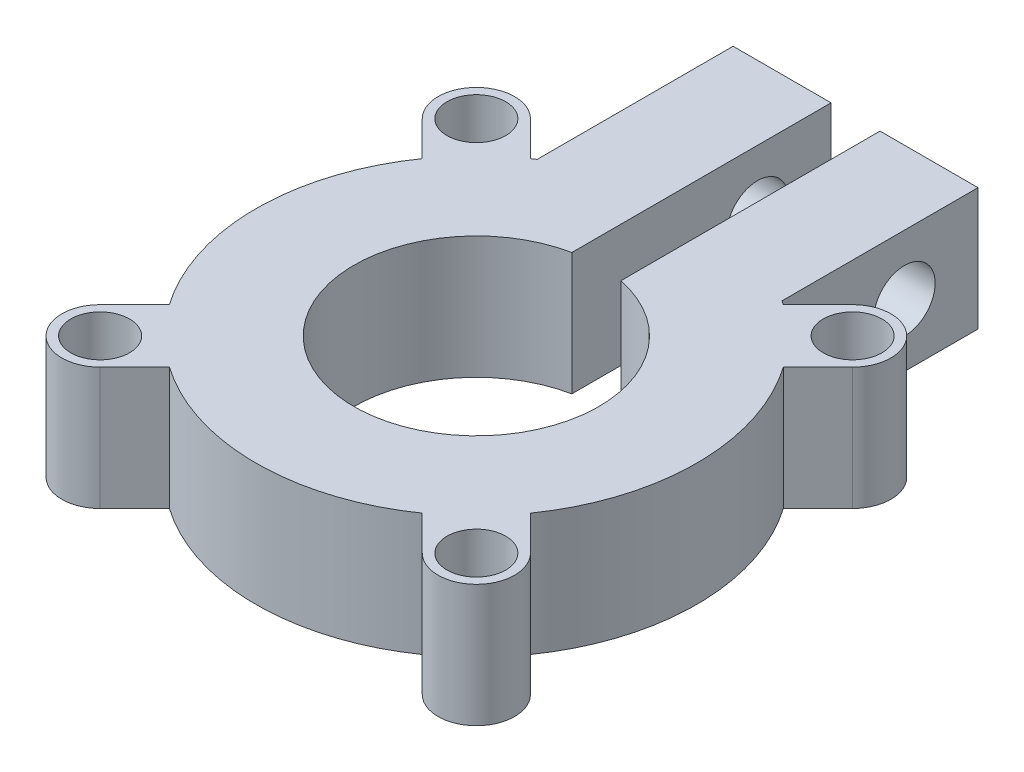
ISO-10303-21;
HEADER;
FILE_DESCRIPTION(('STEP AP214'),'2;1');
FILE_NAME('part.step','',(''),(''),'','','');
FILE_SCHEMA(('AUTOMOTIVE_DESIGN { 1 0 10303 214 1 1 1 1 }'));
ENDSEC;
DATA;
#1=APPLICATION_CONTEXT('core data for automotive mechanical design processes');
#2=APPLICATION_PROTOCOL_DEFINITION('international standard','automotive_design',2000,#1);
#3=PRODUCT_CONTEXT('',#1,'mechanical');
#4=PRODUCT('Part','Part','',(#3));
#5=PRODUCT_RELATED_PRODUCT_CATEGORY('part','',(#4));
#6=PRODUCT_DEFINITION_FORMATION('','',#4);
#7=PRODUCT_DEFINITION_CONTEXT('part definition',#1,'design');
#8=PRODUCT_DEFINITION('design','',#6,#7);
#9=PRODUCT_DEFINITION_SHAPE('','',#8);
#10=(LENGTH_UNIT() NAMED_UNIT(*) SI_UNIT(.MILLI.,.METRE.));
#11=(NAMED_UNIT(*) PLANE_ANGLE_UNIT() SI_UNIT($,.RADIAN.));
#12=(NAMED_UNIT(*) SI_UNIT($,.STERADIAN.) SOLID_ANGLE_UNIT());
#13=UNCERTAINTY_MEASURE_WITH_UNIT(LENGTH_MEASURE(1.E-05),#10,'distance_accuracy_value','');
#14=(GEOMETRIC_REPRESENTATION_CONTEXT(3) GLOBAL_UNCERTAINTY_ASSIGNED_CONTEXT((#13)) GLOBAL_UNIT_ASSIGNED_CONTEXT((#10,
#11,#12)) REPRESENTATION_CONTEXT('',''));
#15=CARTESIAN_POINT('',(0.,0.,0.));
#16=DIRECTION('',(0.,0.,1.));
#17=DIRECTION('',(1.,0.,0.));
#18=AXIS2_PLACEMENT_3D('',#15,#16,#17);
#19=CARTESIAN_POINT('',(0.,3.175,0.));
#20=DIRECTION('',(0.,-1.,0.));
#21=DIRECTION('',(0.,0.,-1.));
#22=AXIS2_PLACEMENT_3D('',#19,#20,#21);
#23=CYLINDRICAL_SURFACE('',#22,5.715);
#24=DIRECTION('',(0.,-1.,0.));
#25=VECTOR('',#24,1.);
#26=CARTESIAN_POINT('',(3.27816553312178,3.175,4.68133055203885));
#27=LINE('',#26,#25);
#28=CARTESIAN_POINT('',(3.27816553312178,3.175,4.68133055203885));
#29=VERTEX_POINT('',#28);
#30=CARTESIAN_POINT('',(3.27816553312178,0.,4.68133055203885));
#31=VERTEX_POINT('',#30);
#32=EDGE_CURVE('E62',#29,#31,#27,.T.);
#33=ORIENTED_EDGE('',*,*,#32,.F.);
#34=CARTESIAN_POINT('',(0.,3.175,0.));
#35=DIRECTION('',(0.,1.,0.));
#36=DIRECTION('',(0.,0.,1.));
#37=AXIS2_PLACEMENT_3D('',#34,#35,#36);
#38=CIRCLE('',#37,5.715);
#39=CARTESIAN_POINT('',(-3.27816553312178,3.175,4.68133055203885));
#40=VERTEX_POINT('',#39);
#41=EDGE_CURVE('E458',#40,#29,#38,.T.);
#42=ORIENTED_EDGE('',*,*,#41,.F.);
#43=DIRECTION('',(0.,-1.,0.));
#44=VECTOR('',#43,1.);
#45=CARTESIAN_POINT('',(-3.27816553312178,3.175,4.68133055203885));
#46=LINE('',#45,#44);
#47=CARTESIAN_POINT('',(-3.27816553312178,0.,4.68133055203885));
#48=VERTEX_POINT('',#47);
#49=EDGE_CURVE('E307',#40,#48,#46,.T.);
#50=ORIENTED_EDGE('',*,*,#49,.T.);
#51=CARTESIAN_POINT('',(0.,0.,0.));
#52=DIRECTION('',(0.,1.,0.));
#53=DIRECTION('',(0.,0.,1.));
#54=AXIS2_PLACEMENT_3D('',#51,#52,#53);
#55=CIRCLE('',#54,5.715);
#56=EDGE_CURVE('E439',#48,#31,#55,.T.);
#57=ORIENTED_EDGE('',*,*,#56,.T.);
#58=EDGE_LOOP('',(#33,#42,#50,#57));
#59=FACE_BOUND('',#58,.T.);
#60=ADVANCED_FACE('F38',(#59),#23,.T.);
#61=CARTESIAN_POINT('',(4.68133055203884,3.175,3.2781655331218));
#62=VERTEX_POINT('',#61);
#63=CARTESIAN_POINT('',(4.68133055203884,3.175,-3.2781655331218));
#64=VERTEX_POINT('',#63);
#65=EDGE_CURVE('E54',#62,#64,#38,.T.);
#66=ORIENTED_EDGE('',*,*,#65,.F.);
#67=DIRECTION('',(0.,-1.,0.));
#68=VECTOR('',#67,1.);
#69=CARTESIAN_POINT('',(4.68133055203884,3.175,3.2781655331218));
#70=LINE('',#69,#68);
#71=CARTESIAN_POINT('',(4.68133055203884,0.,3.2781655331218));
#72=VERTEX_POINT('',#71);
#73=EDGE_CURVE('E224',#62,#72,#70,.T.);
#74=ORIENTED_EDGE('',*,*,#73,.T.);
#75=CARTESIAN_POINT('',(4.68133055203884,0.,-3.2781655331218));
#76=VERTEX_POINT('',#75);
#77=EDGE_CURVE('E397',#72,#76,#55,.T.);
#78=ORIENTED_EDGE('',*,*,#77,.T.);
#79=DIRECTION('',(0.,-1.,0.));
#80=VECTOR('',#79,1.);
#81=CARTESIAN_POINT('',(4.68133055203884,3.175,-3.2781655331218));
#82=LINE('',#81,#80);
#83=EDGE_CURVE('E256',#64,#76,#82,.T.);
#84=ORIENTED_EDGE('',*,*,#83,.F.);
#85=EDGE_LOOP('',(#66,#74,#78,#84));
#86=FACE_BOUND('',#85,.T.);
#87=ADVANCED_FACE('F461',(#86),#23,.T.);
#88=DIRECTION('',(0.,-1.,0.));
#89=VECTOR('',#88,1.);
#90=CARTESIAN_POINT('',(-4.68133055203884,3.175,3.2781655331218));
#91=LINE('',#90,#89);
#92=CARTESIAN_POINT('',(-4.68133055203884,3.175,3.2781655331218));
#93=VERTEX_POINT('',#92);
#94=CARTESIAN_POINT('',(-4.68133055203884,0.,3.2781655331218));
#95=VERTEX_POINT('',#94);
#96=EDGE_CURVE('E290',#93,#95,#91,.T.);
#97=ORIENTED_EDGE('',*,*,#96,.F.);
#98=CARTESIAN_POINT('',(-4.68133055203884,3.175,-3.2781655331218));
#99=VERTEX_POINT('',#98);
#100=EDGE_CURVE('E384',#99,#93,#38,.T.);
#101=ORIENTED_EDGE('',*,*,#100,.F.);
#102=DIRECTION('',(0.,-1.,0.));
#103=VECTOR('',#102,1.);
#104=CARTESIAN_POINT('',(-4.68133055203884,3.175,-3.2781655331218));
#105=LINE('',#104,#103);
#106=CARTESIAN_POINT('',(-4.68133055203884,0.,-3.2781655331218));
#107=VERTEX_POINT('',#106);
#108=EDGE_CURVE('E335',#99,#107,#105,.T.);
#109=ORIENTED_EDGE('',*,*,#108,.T.);
#110=EDGE_CURVE('E396',#107,#95,#55,.T.);
#111=ORIENTED_EDGE('',*,*,#110,.T.);
#112=EDGE_LOOP('',(#97,#101,#109,#111));
#113=FACE_BOUND('',#112,.T.);
#114=ADVANCED_FACE('F442',(#113),#23,.T.);
#115=DIRECTION('',(0.,-1.,0.));
#116=VECTOR('',#115,1.);
#117=CARTESIAN_POINT('',(-3.27816553312178,3.175,-4.68133055203885));
#118=LINE('',#117,#116);
#119=CARTESIAN_POINT('',(-3.27816553312178,3.175,-4.68133055203885));
#120=VERTEX_POINT('',#119);
#121=CARTESIAN_POINT('',(-3.27816553312178,0.,-4.68133055203885));
#122=VERTEX_POINT('',#121);
#123=EDGE_CURVE('E339',#120,#122,#118,.T.);
#124=ORIENTED_EDGE('',*,*,#123,.F.);
#125=CARTESIAN_POINT('',(-3.175,3.175,-4.7519048812029));
#126=VERTEX_POINT('',#125);
#127=EDGE_CURVE('E380',#126,#120,#38,.T.);
#128=ORIENTED_EDGE('',*,*,#127,.F.);
#129=DIRECTION('',(0.,-1.,0.));
#130=VECTOR('',#129,1.);
#131=CARTESIAN_POINT('',(-3.175,3.175,-4.7519048812029));
#132=LINE('',#131,#130);
#133=CARTESIAN_POINT('',(-3.175,0.,-4.7519048812029));
#134=VERTEX_POINT('',#133);
#135=EDGE_CURVE('E392',#126,#134,#132,.T.);
#136=ORIENTED_EDGE('',*,*,#135,.T.);
#137=EDGE_CURVE('E393',#134,#122,#55,.T.);
#138=ORIENTED_EDGE('',*,*,#137,.T.);
#139=EDGE_LOOP('',(#124,#128,#136,#138));
#140=FACE_BOUND('',#139,.T.);
#141=ADVANCED_FACE('F489',(#140),#23,.T.);
#142=CARTESIAN_POINT('',(3.175,3.175,-9.8319048812029));
#143=DIRECTION('',(0.,0.,1.));
#144=DIRECTION('',(1.,0.,0.));
#145=AXIS2_PLACEMENT_3D('',#142,#143,#144);
#146=PLANE('',#145);
#147=DIRECTION('',(-1.,0.,0.));
#148=VECTOR('',#147,1.);
#149=CARTESIAN_POINT('',(3.175,3.175,-9.8319048812029));
#150=LINE('',#149,#148);
#151=CARTESIAN_POINT('',(-0.635,3.175,-9.8319048812029));
#152=VERTEX_POINT('',#151);
#153=CARTESIAN_POINT('',(-3.175,3.175,-9.8319048812029));
#154=VERTEX_POINT('',#153);
#155=EDGE_CURVE('E386',#152,#154,#150,.T.);
#156=ORIENTED_EDGE('',*,*,#155,.F.);
#157=DIRECTION('',(0.,1.,0.));
#158=VECTOR('',#157,1.);
#159=CARTESIAN_POINT('',(-0.635,0.,-9.8319048812029));
#160=LINE('',#159,#158);
#161=CARTESIAN_POINT('',(-0.635,0.,-9.8319048812029));
#162=VERTEX_POINT('',#161);
#163=EDGE_CURVE('E364',#162,#152,#160,.T.);
#164=ORIENTED_EDGE('',*,*,#163,.F.);
#165=DIRECTION('',(-1.,0.,0.));
#166=VECTOR('',#165,1.);
#167=CARTESIAN_POINT('',(3.175,0.,-9.8319048812029));
#168=LINE('',#167,#166);
#169=CARTESIAN_POINT('',(-3.175,0.,-9.8319048812029));
#170=VERTEX_POINT('',#169);
#171=EDGE_CURVE('E399',#162,#170,#168,.T.);
#172=ORIENTED_EDGE('',*,*,#171,.T.);
#173=DIRECTION('',(0.,-1.,0.));
#174=VECTOR('',#173,1.);
#175=CARTESIAN_POINT('',(-3.175,3.175,-9.8319048812029));
#176=LINE('',#175,#174);
#177=EDGE_CURVE('E408',#154,#170,#176,.T.);
#178=ORIENTED_EDGE('',*,*,#177,.F.);
#179=EDGE_LOOP('',(#156,#164,#172,#178));
#180=FACE_BOUND('',#179,.T.);
#181=ADVANCED_FACE('F497',(#180),#146,.F.);
#182=CARTESIAN_POINT('',(0.,3.175,0.));
#183=DIRECTION('',(0.,1.,0.));
#184=DIRECTION('',(0.,0.,1.));
#185=AXIS2_PLACEMENT_3D('',#182,#183,#184);
#186=PLANE('',#185);
#187=DIRECTION('',(0.,0.,1.));
#188=VECTOR('',#187,1.);
#189=CARTESIAN_POINT('',(-0.635,3.175,-9.8319048812029));
#190=LINE('',#189,#188);
#191=CARTESIAN_POINT('',(-0.635000000000002,3.175,-3.11085197333464));
#192=VERTEX_POINT('',#191);
#193=EDGE_CURVE('E353',#152,#192,#190,.T.);
#194=ORIENTED_EDGE('',*,*,#193,.F.);
#195=ORIENTED_EDGE('',*,*,#155,.T.);
#196=DIRECTION('',(0.,0.,1.));
#197=VECTOR('',#196,1.);
#198=CARTESIAN_POINT('',(-3.175,3.175,-4.7519048812029));
#199=LINE('',#198,#197);
#200=EDGE_CURVE('E390',#154,#126,#199,.T.);
#201=ORIENTED_EDGE('',*,*,#200,.T.);
#202=ORIENTED_EDGE('',*,*,#127,.T.);
#203=DIRECTION('',(-0.707106781186547,0.,-0.707106781186549));
#204=VECTOR('',#203,1.);
#205=CARTESIAN_POINT('',(0.701582509458532,3.175,-0.70158250945853));
#206=LINE('',#205,#204);
#207=CARTESIAN_POINT('',(-4.17619114522869,3.175,-5.57935616414577));
#208=VERTEX_POINT('',#207);
#209=EDGE_CURVE('E322',#120,#208,#206,.T.);
#210=ORIENTED_EDGE('',*,*,#209,.T.);
#211=CARTESIAN_POINT('',(-4.87777365468722,3.175,-4.87777365468724));
#212=DIRECTION('',(0.,-1.,0.));
#213=DIRECTION('',(0.,0.,-1.));
#214=AXIS2_PLACEMENT_3D('',#211,#212,#213);
#215=CIRCLE('',#214,0.9921875);
#216=CARTESIAN_POINT('',(-5.57935616414575,3.175,-4.17619114522872));
#217=VERTEX_POINT('',#216);
#218=EDGE_CURVE('E319',#217,#208,#215,.T.);
#219=ORIENTED_EDGE('',*,*,#218,.F.);
#220=DIRECTION('',(-0.707106781186546,0.,-0.707106781186549));
#221=VECTOR('',#220,1.);
#222=CARTESIAN_POINT('',(-0.701582509458529,3.175,0.701582509458526));
#223=LINE('',#222,#221);
#224=EDGE_CURVE('E315',#99,#217,#223,.T.);
#225=ORIENTED_EDGE('',*,*,#224,.F.);
#226=ORIENTED_EDGE('',*,*,#100,.T.);
#227=DIRECTION('',(-0.707106781186546,0.,0.707106781186549));
#228=VECTOR('',#227,1.);
#229=CARTESIAN_POINT('',(-0.701582509458529,3.175,-0.701582509458526));
#230=LINE('',#229,#228);
#231=CARTESIAN_POINT('',(-5.57935616414575,3.175,4.17619114522872));
#232=VERTEX_POINT('',#231);
#233=EDGE_CURVE('E281',#93,#232,#230,.T.);
#234=ORIENTED_EDGE('',*,*,#233,.T.);
#235=CARTESIAN_POINT('',(-4.87777365468722,3.175,4.87777365468724));
#236=DIRECTION('',(0.,1.,0.));
#237=DIRECTION('',(0.,0.,1.));
#238=AXIS2_PLACEMENT_3D('',#235,#236,#237);
#239=CIRCLE('',#238,0.9921875);
#240=CARTESIAN_POINT('',(-4.17619114522869,3.175,5.57935616414577));
#241=VERTEX_POINT('',#240);
#242=EDGE_CURVE('E288',#232,#241,#239,.T.);
#243=ORIENTED_EDGE('',*,*,#242,.T.);
#244=DIRECTION('',(-0.707106781186547,0.,0.707106781186549));
#245=VECTOR('',#244,1.);
#246=CARTESIAN_POINT('',(0.701582509458532,3.175,0.70158250945853));
#247=LINE('',#246,#245);
#248=EDGE_CURVE('E285',#40,#241,#247,.T.);
#249=ORIENTED_EDGE('',*,*,#248,.F.);
#250=ORIENTED_EDGE('',*,*,#41,.T.);
#251=DIRECTION('',(0.707106781186547,0.,0.707106781186549));
#252=VECTOR('',#251,1.);
#253=CARTESIAN_POINT('',(-0.701582509458532,3.175,0.70158250945853));
#254=LINE('',#253,#252);
#255=CARTESIAN_POINT('',(4.17619114522869,3.175,5.57935616414577));
#256=VERTEX_POINT('',#255);
#257=EDGE_CURVE('E212',#29,#256,#254,.T.);
#258=ORIENTED_EDGE('',*,*,#257,.T.);
#259=CARTESIAN_POINT('',(4.87777365468722,3.175,4.87777365468724));
#260=DIRECTION('',(0.,-1.,0.));
#261=DIRECTION('',(0.,0.,1.));
#262=AXIS2_PLACEMENT_3D('',#259,#260,#261);
#263=CIRCLE('',#262,0.9921875);
#264=CARTESIAN_POINT('',(5.57935616414575,3.175,4.17619114522872));
#265=VERTEX_POINT('',#264);
#266=EDGE_CURVE('E204',#265,#256,#263,.T.);
#267=ORIENTED_EDGE('',*,*,#266,.F.);
#268=DIRECTION('',(0.707106781186546,0.,0.707106781186549));
#269=VECTOR('',#268,1.);
#270=CARTESIAN_POINT('',(0.701582509458529,3.175,-0.701582509458526));
#271=LINE('',#270,#269);
#272=EDGE_CURVE('E219',#62,#265,#271,.T.);
#273=ORIENTED_EDGE('',*,*,#272,.F.);
#274=ORIENTED_EDGE('',*,*,#65,.T.);
#275=DIRECTION('',(0.707106781186546,0.,-0.707106781186549));
#276=VECTOR('',#275,1.);
#277=CARTESIAN_POINT('',(0.701582509458529,3.175,0.701582509458526));
#278=LINE('',#277,#276);
#279=CARTESIAN_POINT('',(5.57935616414575,3.175,-4.17619114522872));
#280=VERTEX_POINT('',#279);
#281=EDGE_CURVE('E247',#64,#280,#278,.T.);
#282=ORIENTED_EDGE('',*,*,#281,.T.);
#283=CARTESIAN_POINT('',(4.87777365468722,3.175,-4.87777365468724));
#284=DIRECTION('',(0.,1.,0.));
#285=DIRECTION('',(0.,0.,-1.));
#286=AXIS2_PLACEMENT_3D('',#283,#284,#285);
#287=CIRCLE('',#286,0.9921875);
#288=CARTESIAN_POINT('',(4.17619114522869,3.175,-5.57935616414577));
#289=VERTEX_POINT('',#288);
#290=EDGE_CURVE('E254',#280,#289,#287,.T.);
#291=ORIENTED_EDGE('',*,*,#290,.T.);
#292=DIRECTION('',(0.707106781186547,0.,-0.707106781186549));
#293=VECTOR('',#292,1.);
#294=CARTESIAN_POINT('',(-0.701582509458532,3.175,-0.70158250945853));
#295=LINE('',#294,#293);
#296=CARTESIAN_POINT('',(3.27816553312178,3.175,-4.68133055203885));
#297=VERTEX_POINT('',#296);
#298=EDGE_CURVE('E251',#297,#289,#295,.T.);
#299=ORIENTED_EDGE('',*,*,#298,.F.);
#300=CARTESIAN_POINT('',(3.175,3.175,-4.7519048812029));
#301=VERTEX_POINT('',#300);
#302=EDGE_CURVE('E405',#297,#301,#38,.T.);
#303=ORIENTED_EDGE('',*,*,#302,.T.);
#304=DIRECTION('',(0.,0.,-1.));
#305=VECTOR('',#304,1.);
#306=CARTESIAN_POINT('',(3.175,3.175,-4.7519048812029));
#307=LINE('',#306,#305);
#308=CARTESIAN_POINT('',(3.175,3.175,-9.8319048812029));
#309=VERTEX_POINT('',#308);
#310=EDGE_CURVE('E383',#301,#309,#307,.T.);
#311=ORIENTED_EDGE('',*,*,#310,.T.);
#312=CARTESIAN_POINT('',(0.635,3.175,-9.8319048812029));
#313=VERTEX_POINT('',#312);
#314=EDGE_CURVE('E387',#309,#313,#150,.T.);
#315=ORIENTED_EDGE('',*,*,#314,.T.);
#316=DIRECTION('',(0.,0.,-1.));
#317=VECTOR('',#316,1.);
#318=CARTESIAN_POINT('',(0.635,3.175,-9.8319048812029));
#319=LINE('',#318,#317);
#320=CARTESIAN_POINT('',(0.634999999999999,3.175,-3.11085197333464));
#321=VERTEX_POINT('',#320);
#322=EDGE_CURVE('E358',#321,#313,#319,.T.);
#323=ORIENTED_EDGE('',*,*,#322,.F.);
#324=CARTESIAN_POINT('',(0.,3.175,0.));
#325=DIRECTION('',(0.,1.,0.));
#326=DIRECTION('',(0.,0.,1.));
#327=AXIS2_PLACEMENT_3D('',#324,#325,#326);
#328=CIRCLE('',#327,3.175);
#329=EDGE_CURVE('E374',#192,#321,#328,.T.);
#330=ORIENTED_EDGE('',*,*,#329,.F.);
#331=EDGE_LOOP('',(#194,#195,#201,#202,#210,#219,#225,#226,#234,#243,#249,#250,#258,#267,#273,
#274,#282,#291,#299,#303,#311,#315,#323,#330));
#332=FACE_BOUND('',#331,.T.);
#333=CARTESIAN_POINT('',(-4.87777365468725,3.175,-4.87777365468722));
#334=DIRECTION('',(0.,-1.,0.));
#335=DIRECTION('',(0.,0.,-1.));
#336=AXIS2_PLACEMENT_3D('',#333,#334,#335);
#337=CIRCLE('',#336,0.761999999999999);
#338=CARTESIAN_POINT('',(-4.87777365468725,3.175,-5.63977365468722));
#339=VERTEX_POINT('',#338);
#340=EDGE_CURVE('E312',#339,#339,#337,.T.);
#341=ORIENTED_EDGE('',*,*,#340,.T.);
#342=EDGE_LOOP('',(#341));
#343=FACE_BOUND('',#342,.T.);
#344=CARTESIAN_POINT('',(-4.87777365468725,3.175,4.87777365468722));
#345=DIRECTION('',(0.,1.,0.));
#346=DIRECTION('',(0.,0.,1.));
#347=AXIS2_PLACEMENT_3D('',#344,#345,#346);
#348=CIRCLE('',#347,0.761999999999999);
#349=CARTESIAN_POINT('',(-4.87777365468725,3.175,5.63977365468722));
#350=VERTEX_POINT('',#349);
#351=EDGE_CURVE('E278',#350,#350,#348,.T.);
#352=ORIENTED_EDGE('',*,*,#351,.F.);
#353=EDGE_LOOP('',(#352));
#354=FACE_BOUND('',#353,.T.);
#355=CARTESIAN_POINT('',(4.87777365468725,3.175,-4.87777365468722));
#356=DIRECTION('',(0.,1.,0.));
#357=DIRECTION('',(0.,0.,-1.));
#358=AXIS2_PLACEMENT_3D('',#355,#356,#357);
#359=CIRCLE('',#358,0.761999999999999);
#360=CARTESIAN_POINT('',(4.87777365468725,3.175,-5.63977365468722));
#361=VERTEX_POINT('',#360);
#362=EDGE_CURVE('E244',#361,#361,#359,.T.);
#363=ORIENTED_EDGE('',*,*,#362,.F.);
#364=EDGE_LOOP('',(#363));
#365=FACE_BOUND('',#364,.T.);
#366=CARTESIAN_POINT('',(4.87777365468725,3.175,4.87777365468722));
#367=DIRECTION('',(0.,-1.,0.));
#368=DIRECTION('',(0.,0.,1.));
#369=AXIS2_PLACEMENT_3D('',#366,#367,#368);
#370=CIRCLE('',#369,0.761999999999999);
#371=CARTESIAN_POINT('',(4.87777365468725,3.175,5.63977365468722));
#372=VERTEX_POINT('',#371);
#373=EDGE_CURVE('E225',#372,#372,#370,.T.);
#374=ORIENTED_EDGE('',*,*,#373,.T.);
#375=EDGE_LOOP('',(#374));
#376=FACE_BOUND('',#375,.T.);
#377=ADVANCED_FACE('F217',(#332,#343,#354,#365,#376),#186,.T.);
#378=CARTESIAN_POINT('',(0.,0.,0.));
#379=DIRECTION('',(0.,1.,0.));
#380=DIRECTION('',(0.,0.,1.));
#381=AXIS2_PLACEMENT_3D('',#378,#379,#380);
#382=PLANE('',#381);
#383=ORIENTED_EDGE('',*,*,#171,.F.);
#384=DIRECTION('',(0.,0.,1.));
#385=VECTOR('',#384,1.);
#386=CARTESIAN_POINT('',(-0.635,0.,-9.8319048812029));
#387=LINE('',#386,#385);
#388=CARTESIAN_POINT('',(-0.634999999999999,0.,-3.11085197333464));
#389=VERTEX_POINT('',#388);
#390=EDGE_CURVE('E354',#162,#389,#387,.T.);
#391=ORIENTED_EDGE('',*,*,#390,.T.);
#392=CARTESIAN_POINT('',(0.,0.,0.));
#393=DIRECTION('',(0.,1.,0.));
#394=DIRECTION('',(0.,0.,1.));
#395=AXIS2_PLACEMENT_3D('',#392,#393,#394);
#396=CIRCLE('',#395,3.175);
#397=CARTESIAN_POINT('',(0.634999999999999,0.,-3.11085197333464));
#398=VERTEX_POINT('',#397);
#399=EDGE_CURVE('E366',#389,#398,#396,.T.);
#400=ORIENTED_EDGE('',*,*,#399,.T.);
#401=DIRECTION('',(0.,0.,-1.));
#402=VECTOR('',#401,1.);
#403=CARTESIAN_POINT('',(0.635,0.,-9.8319048812029));
#404=LINE('',#403,#402);
#405=CARTESIAN_POINT('',(0.635,0.,-9.8319048812029));
#406=VERTEX_POINT('',#405);
#407=EDGE_CURVE('E357',#398,#406,#404,.T.);
#408=ORIENTED_EDGE('',*,*,#407,.T.);
#409=CARTESIAN_POINT('',(3.175,0.,-9.8319048812029));
#410=VERTEX_POINT('',#409);
#411=EDGE_CURVE('E400',#410,#406,#168,.T.);
#412=ORIENTED_EDGE('',*,*,#411,.F.);
#413=DIRECTION('',(0.,0.,-1.));
#414=VECTOR('',#413,1.);
#415=CARTESIAN_POINT('',(3.175,0.,-4.7519048812029));
#416=LINE('',#415,#414);
#417=CARTESIAN_POINT('',(3.175,0.,-4.7519048812029));
#418=VERTEX_POINT('',#417);
#419=EDGE_CURVE('E395',#418,#410,#416,.T.);
#420=ORIENTED_EDGE('',*,*,#419,.F.);
#421=CARTESIAN_POINT('',(3.27816553312178,0.,-4.68133055203885));
#422=VERTEX_POINT('',#421);
#423=EDGE_CURVE('E377',#422,#418,#55,.T.);
#424=ORIENTED_EDGE('',*,*,#423,.F.);
#425=DIRECTION('',(0.707106781186547,0.,-0.707106781186549));
#426=VECTOR('',#425,1.);
#427=CARTESIAN_POINT('',(-0.701582509458532,0.,-0.70158250945853));
#428=LINE('',#427,#426);
#429=CARTESIAN_POINT('',(4.17619114522869,0.,-5.57935616414577));
#430=VERTEX_POINT('',#429);
#431=EDGE_CURVE('E262',#422,#430,#428,.T.);
#432=ORIENTED_EDGE('',*,*,#431,.T.);
#433=CARTESIAN_POINT('',(4.87777365468722,0.,-4.87777365468724));
#434=DIRECTION('',(0.,1.,0.));
#435=DIRECTION('',(0.,0.,-1.));
#436=AXIS2_PLACEMENT_3D('',#433,#434,#435);
#437=CIRCLE('',#436,0.9921875);
#438=CARTESIAN_POINT('',(5.57935616414575,0.,-4.17619114522872));
#439=VERTEX_POINT('',#438);
#440=EDGE_CURVE('E248',#439,#430,#437,.T.);
#441=ORIENTED_EDGE('',*,*,#440,.F.);
#442=DIRECTION('',(0.707106781186546,0.,-0.707106781186549));
#443=VECTOR('',#442,1.);
#444=CARTESIAN_POINT('',(0.701582509458529,0.,0.701582509458526));
#445=LINE('',#444,#443);
#446=EDGE_CURVE('E259',#76,#439,#445,.T.);
#447=ORIENTED_EDGE('',*,*,#446,.F.);
#448=ORIENTED_EDGE('',*,*,#77,.F.);
#449=DIRECTION('',(0.707106781186546,0.,0.707106781186549));
#450=VECTOR('',#449,1.);
#451=CARTESIAN_POINT('',(0.701582509458529,0.,-0.701582509458526));
#452=LINE('',#451,#450);
#453=CARTESIAN_POINT('',(5.57935616414575,0.,4.17619114522872));
#454=VERTEX_POINT('',#453);
#455=EDGE_CURVE('E235',#72,#454,#452,.T.);
#456=ORIENTED_EDGE('',*,*,#455,.T.);
#457=CARTESIAN_POINT('',(4.87777365468722,0.,4.87777365468724));
#458=DIRECTION('',(0.,-1.,0.));
#459=DIRECTION('',(0.,0.,1.));
#460=AXIS2_PLACEMENT_3D('',#457,#458,#459);
#461=CIRCLE('',#460,0.9921875);
#462=CARTESIAN_POINT('',(4.17619114522869,0.,5.57935616414577));
#463=VERTEX_POINT('',#462);
#464=EDGE_CURVE('E206',#454,#463,#461,.T.);
#465=ORIENTED_EDGE('',*,*,#464,.T.);
#466=DIRECTION('',(0.707106781186547,0.,0.707106781186549));
#467=VECTOR('',#466,1.);
#468=CARTESIAN_POINT('',(-0.701582509458532,0.,0.70158250945853));
#469=LINE('',#468,#467);
#470=EDGE_CURVE('E228',#31,#463,#469,.T.);
#471=ORIENTED_EDGE('',*,*,#470,.F.);
#472=ORIENTED_EDGE('',*,*,#56,.F.);
#473=DIRECTION('',(-0.707106781186547,0.,0.707106781186549));
#474=VECTOR('',#473,1.);
#475=CARTESIAN_POINT('',(0.701582509458532,0.,0.70158250945853));
#476=LINE('',#475,#474);
#477=CARTESIAN_POINT('',(-4.17619114522869,0.,5.57935616414577));
#478=VERTEX_POINT('',#477);
#479=EDGE_CURVE('E296',#48,#478,#476,.T.);
#480=ORIENTED_EDGE('',*,*,#479,.T.);
#481=CARTESIAN_POINT('',(-4.87777365468722,0.,4.87777365468724));
#482=DIRECTION('',(0.,1.,0.));
#483=DIRECTION('',(0.,0.,1.));
#484=AXIS2_PLACEMENT_3D('',#481,#482,#483);
#485=CIRCLE('',#484,0.9921875);
#486=CARTESIAN_POINT('',(-5.57935616414575,0.,4.17619114522872));
#487=VERTEX_POINT('',#486);
#488=EDGE_CURVE('E282',#487,#478,#485,.T.);
#489=ORIENTED_EDGE('',*,*,#488,.F.);
#490=DIRECTION('',(-0.707106781186546,0.,0.707106781186549));
#491=VECTOR('',#490,1.);
#492=CARTESIAN_POINT('',(-0.701582509458529,0.,-0.701582509458526));
#493=LINE('',#492,#491);
#494=EDGE_CURVE('E293',#95,#487,#493,.T.);
#495=ORIENTED_EDGE('',*,*,#494,.F.);
#496=ORIENTED_EDGE('',*,*,#110,.F.);
#497=DIRECTION('',(-0.707106781186546,0.,-0.707106781186549));
#498=VECTOR('',#497,1.);
#499=CARTESIAN_POINT('',(-0.701582509458529,0.,0.701582509458526));
#500=LINE('',#499,#498);
#501=CARTESIAN_POINT('',(-5.57935616414575,0.,-4.17619114522872));
#502=VERTEX_POINT('',#501);
#503=EDGE_CURVE('E327',#107,#502,#500,.T.);
#504=ORIENTED_EDGE('',*,*,#503,.T.);
#505=CARTESIAN_POINT('',(-4.87777365468722,0.,-4.87777365468724));
#506=DIRECTION('',(0.,-1.,0.));
#507=DIRECTION('',(0.,0.,-1.));
#508=AXIS2_PLACEMENT_3D('',#505,#506,#507);
#509=CIRCLE('',#508,0.9921875);
#510=CARTESIAN_POINT('',(-4.17619114522869,0.,-5.57935616414577));
#511=VERTEX_POINT('',#510);
#512=EDGE_CURVE('E330',#502,#511,#509,.T.);
#513=ORIENTED_EDGE('',*,*,#512,.T.);
#514=DIRECTION('',(-0.707106781186547,0.,-0.707106781186549));
#515=VECTOR('',#514,1.);
#516=CARTESIAN_POINT('',(0.701582509458532,0.,-0.70158250945853));
#517=LINE('',#516,#515);
#518=EDGE_CURVE('E316',#122,#511,#517,.T.);
#519=ORIENTED_EDGE('',*,*,#518,.F.);
#520=ORIENTED_EDGE('',*,*,#137,.F.);
#521=DIRECTION('',(0.,0.,1.));
#522=VECTOR('',#521,1.);
#523=CARTESIAN_POINT('',(-3.175,0.,-4.7519048812029));
#524=LINE('',#523,#522);
#525=EDGE_CURVE('E403',#170,#134,#524,.T.);
#526=ORIENTED_EDGE('',*,*,#525,.F.);
#527=EDGE_LOOP('',(#383,#391,#400,#408,#412,#420,#424,#432,#441,#447,#448,#456,#465,#471,#472,
#480,#489,#495,#496,#504,#513,#519,#520,#526));
#528=FACE_BOUND('',#527,.T.);
#529=CARTESIAN_POINT('',(-4.87777365468725,0.,-4.87777365468722));
#530=DIRECTION('',(0.,-1.,0.));
#531=DIRECTION('',(0.,0.,-1.));
#532=AXIS2_PLACEMENT_3D('',#529,#530,#531);
#533=CIRCLE('',#532,0.761999999999999);
#534=CARTESIAN_POINT('',(-4.87777365468725,0.,-5.63977365468722));
#535=VERTEX_POINT('',#534);
#536=EDGE_CURVE('E304',#535,#535,#533,.T.);
#537=ORIENTED_EDGE('',*,*,#536,.F.);
#538=EDGE_LOOP('',(#537));
#539=FACE_BOUND('',#538,.T.);
#540=CARTESIAN_POINT('',(-4.87777365468725,0.,4.87777365468722));
#541=DIRECTION('',(0.,1.,0.));
#542=DIRECTION('',(0.,0.,1.));
#543=AXIS2_PLACEMENT_3D('',#540,#541,#542);
#544=CIRCLE('',#543,0.761999999999999);
#545=CARTESIAN_POINT('',(-4.87777365468725,0.,5.63977365468722));
#546=VERTEX_POINT('',#545);
#547=EDGE_CURVE('E270',#546,#546,#544,.T.);
#548=ORIENTED_EDGE('',*,*,#547,.T.);
#549=EDGE_LOOP('',(#548));
#550=FACE_BOUND('',#549,.T.);
#551=CARTESIAN_POINT('',(4.87777365468725,0.,-4.87777365468722));
#552=DIRECTION('',(0.,1.,0.));
#553=DIRECTION('',(0.,0.,-1.));
#554=AXIS2_PLACEMENT_3D('',#551,#552,#553);
#555=CIRCLE('',#554,0.761999999999999);
#556=CARTESIAN_POINT('',(4.87777365468725,0.,-5.63977365468722));
#557=VERTEX_POINT('',#556);
#558=EDGE_CURVE('E241',#557,#557,#555,.T.);
#559=ORIENTED_EDGE('',*,*,#558,.T.);
#560=EDGE_LOOP('',(#559));
#561=FACE_BOUND('',#560,.T.);
#562=CARTESIAN_POINT('',(4.87777365468725,0.,4.87777365468722));
#563=DIRECTION('',(0.,-1.,0.));
#564=DIRECTION('',(0.,0.,1.));
#565=AXIS2_PLACEMENT_3D('',#562,#563,#564);
#566=CIRCLE('',#565,0.761999999999999);
#567=CARTESIAN_POINT('',(4.87777365468725,0.,5.63977365468722));
#568=VERTEX_POINT('',#567);
#569=EDGE_CURVE('E232',#568,#568,#566,.T.);
#570=ORIENTED_EDGE('',*,*,#569,.F.);
#571=EDGE_LOOP('',(#570));
#572=FACE_BOUND('',#571,.T.);
#573=ADVANCED_FACE('F422',(#528,#539,#550,#561,#572),#382,.F.);
#574=ORIENTED_EDGE('',*,*,#302,.F.);
#575=DIRECTION('',(0.,-1.,0.));
#576=VECTOR('',#575,1.);
#577=CARTESIAN_POINT('',(3.27816553312178,3.175,-4.68133055203885));
#578=LINE('',#577,#576);
#579=EDGE_CURVE('E273',#297,#422,#578,.T.);
#580=ORIENTED_EDGE('',*,*,#579,.T.);
#581=ORIENTED_EDGE('',*,*,#423,.T.);
#582=DIRECTION('',(0.,-1.,0.));
#583=VECTOR('',#582,1.);
#584=CARTESIAN_POINT('',(3.175,3.175,-4.7519048812029));
#585=LINE('',#584,#583);
#586=EDGE_CURVE('E11',#301,#418,#585,.T.);
#587=ORIENTED_EDGE('',*,*,#586,.F.);
#588=EDGE_LOOP('',(#574,#580,#581,#587));
#589=FACE_BOUND('',#588,.T.);
#590=ADVANCED_FACE('F40',(#589),#23,.T.);
#591=CARTESIAN_POINT('',(3.175,3.175,-4.7519048812029));
#592=DIRECTION('',(-1.,0.,0.));
#593=DIRECTION('',(0.,0.,1.));
#594=AXIS2_PLACEMENT_3D('',#591,#592,#593);
#595=PLANE('',#594);
#596=CARTESIAN_POINT('',(3.175,1.5875,-7.9269048812029));
#597=DIRECTION('',(1.,0.,0.));
#598=DIRECTION('',(0.,0.,-1.));
#599=AXIS2_PLACEMENT_3D('',#596,#597,#598);
#600=CIRCLE('',#599,0.793750000000001);
#601=CARTESIAN_POINT('',(3.175,1.5875,-8.72065488120291));
#602=VERTEX_POINT('',#601);
#603=EDGE_CURVE('E338',#602,#602,#600,.T.);
#604=ORIENTED_EDGE('',*,*,#603,.F.);
#605=EDGE_LOOP('',(#604));
#606=FACE_BOUND('',#605,.T.);
#607=ORIENTED_EDGE('',*,*,#419,.T.);
#608=DIRECTION('',(0.,-1.,0.));
#609=VECTOR('',#608,1.);
#610=CARTESIAN_POINT('',(3.175,3.175,-9.8319048812029));
#611=LINE('',#610,#609);
#612=EDGE_CURVE('E47',#309,#410,#611,.T.);
#613=ORIENTED_EDGE('',*,*,#612,.F.);
#614=ORIENTED_EDGE('',*,*,#310,.F.);
#615=ORIENTED_EDGE('',*,*,#586,.T.);
#616=EDGE_LOOP('',(#607,#613,#614,#615));
#617=FACE_BOUND('',#616,.T.);
#618=ADVANCED_FACE('F435',(#606,#617),#595,.F.);
#619=ORIENTED_EDGE('',*,*,#411,.T.);
#620=DIRECTION('',(0.,1.,0.));
#621=VECTOR('',#620,1.);
#622=CARTESIAN_POINT('',(0.635,0.,-9.8319048812029));
#623=LINE('',#622,#621);
#624=EDGE_CURVE('E367',#406,#313,#623,.T.);
#625=ORIENTED_EDGE('',*,*,#624,.T.);
#626=ORIENTED_EDGE('',*,*,#314,.F.);
#627=ORIENTED_EDGE('',*,*,#612,.T.);
#628=EDGE_LOOP('',(#619,#625,#626,#627));
#629=FACE_BOUND('',#628,.T.);
#630=ADVANCED_FACE('F416',(#629),#146,.F.);
#631=CARTESIAN_POINT('',(-3.175,3.175,-4.7519048812029));
#632=DIRECTION('',(1.,0.,0.));
#633=DIRECTION('',(0.,0.,-1.));
#634=AXIS2_PLACEMENT_3D('',#631,#632,#633);
#635=PLANE('',#634);
#636=CARTESIAN_POINT('',(-3.175,1.5875,-7.9269048812029));
#637=DIRECTION('',(1.,0.,0.));
#638=DIRECTION('',(0.,0.,-1.));
#639=AXIS2_PLACEMENT_3D('',#636,#637,#638);
#640=CIRCLE('',#639,0.793750000000001);
#641=CARTESIAN_POINT('',(-3.175,1.5875,-8.72065488120291));
#642=VERTEX_POINT('',#641);
#643=EDGE_CURVE('E350',#642,#642,#640,.T.);
#644=ORIENTED_EDGE('',*,*,#643,.T.);
#645=EDGE_LOOP('',(#644));
#646=FACE_BOUND('',#645,.T.);
#647=ORIENTED_EDGE('',*,*,#525,.T.);
#648=ORIENTED_EDGE('',*,*,#135,.F.);
#649=ORIENTED_EDGE('',*,*,#200,.F.);
#650=ORIENTED_EDGE('',*,*,#177,.T.);
#651=EDGE_LOOP('',(#647,#648,#649,#650));
#652=FACE_BOUND('',#651,.T.);
#653=ADVANCED_FACE('F521',(#646,#652),#635,.F.);
#654=CARTESIAN_POINT('',(0.,3.175,0.));
#655=DIRECTION('',(0.,-1.,0.));
#656=DIRECTION('',(0.,0.,-1.));
#657=AXIS2_PLACEMENT_3D('',#654,#655,#656);
#658=CYLINDRICAL_SURFACE('',#657,3.175);
#659=DIRECTION('',(0.,1.,0.));
#660=VECTOR('',#659,1.);
#661=CARTESIAN_POINT('',(-0.634999999999999,0.,-3.11085197333464));
#662=LINE('',#661,#660);
#663=EDGE_CURVE('E361',#389,#192,#662,.T.);
#664=ORIENTED_EDGE('',*,*,#663,.T.);
#665=ORIENTED_EDGE('',*,*,#329,.T.);
#666=DIRECTION('',(0.,1.,0.));
#667=VECTOR('',#666,1.);
#668=CARTESIAN_POINT('',(0.634999999999999,0.,-3.11085197333464));
#669=LINE('',#668,#667);
#670=EDGE_CURVE('E370',#398,#321,#669,.T.);
#671=ORIENTED_EDGE('',*,*,#670,.F.);
#672=ORIENTED_EDGE('',*,*,#399,.F.);
#673=EDGE_LOOP('',(#664,#665,#671,#672));
#674=FACE_BOUND('',#673,.T.);
#675=ADVANCED_FACE('F430',(#674),#658,.F.);
#676=CARTESIAN_POINT('',(0.635,0.,-9.8319048812029));
#677=DIRECTION('',(1.,0.,0.));
#678=DIRECTION('',(0.,0.,-1.));
#679=AXIS2_PLACEMENT_3D('',#676,#677,#678);
#680=PLANE('',#679);
#681=CARTESIAN_POINT('',(0.635,1.5875,-7.9269048812029));
#682=DIRECTION('',(1.,0.,0.));
#683=DIRECTION('',(0.,0.,-1.));
#684=AXIS2_PLACEMENT_3D('',#681,#682,#683);
#685=CIRCLE('',#684,0.793750000000001);
#686=CARTESIAN_POINT('',(0.635,1.5875,-8.72065488120291));
#687=VERTEX_POINT('',#686);
#688=EDGE_CURVE('E347',#687,#687,#685,.T.);
#689=ORIENTED_EDGE('',*,*,#688,.T.);
#690=EDGE_LOOP('',(#689));
#691=FACE_BOUND('',#690,.T.);
#692=ORIENTED_EDGE('',*,*,#322,.T.);
#693=ORIENTED_EDGE('',*,*,#624,.F.);
#694=ORIENTED_EDGE('',*,*,#407,.F.);
#695=ORIENTED_EDGE('',*,*,#670,.T.);
#696=EDGE_LOOP('',(#692,#693,#694,#695));
#697=FACE_BOUND('',#696,.T.);
#698=ADVANCED_FACE('F427',(#691,#697),#680,.F.);
#699=CARTESIAN_POINT('',(-0.635,0.,-9.8319048812029));
#700=DIRECTION('',(-1.,0.,0.));
#701=DIRECTION('',(0.,0.,1.));
#702=AXIS2_PLACEMENT_3D('',#699,#700,#701);
#703=PLANE('',#702);
#704=CARTESIAN_POINT('',(-0.635,1.5875,-7.9269048812029));
#705=DIRECTION('',(-1.,0.,0.));
#706=DIRECTION('',(0.,0.,1.));
#707=AXIS2_PLACEMENT_3D('',#704,#705,#706);
#708=CIRCLE('',#707,0.793750000000001);
#709=CARTESIAN_POINT('',(-0.635,1.5875,-7.1331548812029));
#710=VERTEX_POINT('',#709);
#711=EDGE_CURVE('E42',#710,#710,#708,.T.);
#712=ORIENTED_EDGE('',*,*,#711,.T.);
#713=EDGE_LOOP('',(#712));
#714=FACE_BOUND('',#713,.T.);
#715=ORIENTED_EDGE('',*,*,#193,.T.);
#716=ORIENTED_EDGE('',*,*,#663,.F.);
#717=ORIENTED_EDGE('',*,*,#390,.F.);
#718=ORIENTED_EDGE('',*,*,#163,.T.);
#719=EDGE_LOOP('',(#715,#716,#717,#718));
#720=FACE_BOUND('',#719,.T.);
#721=ADVANCED_FACE('F525',(#714,#720),#703,.F.);
#722=CARTESIAN_POINT('',(-5.715,1.5875,-7.9269048812029));
#723=DIRECTION('',(1.,0.,0.));
#724=DIRECTION('',(0.,0.,-1.));
#725=AXIS2_PLACEMENT_3D('',#722,#723,#724);
#726=CYLINDRICAL_SURFACE('',#725,0.793750000000001);
#727=ORIENTED_EDGE('',*,*,#711,.F.);
#728=EDGE_LOOP('',(#727));
#729=FACE_BOUND('',#728,.T.);
#730=ORIENTED_EDGE('',*,*,#643,.F.);
#731=EDGE_LOOP('',(#730));
#732=FACE_BOUND('',#731,.T.);
#733=ADVANCED_FACE('F527',(#729,#732),#726,.F.);
#734=ORIENTED_EDGE('',*,*,#603,.T.);
#735=EDGE_LOOP('',(#734));
#736=FACE_BOUND('',#735,.T.);
#737=ORIENTED_EDGE('',*,*,#688,.F.);
#738=EDGE_LOOP('',(#737));
#739=FACE_BOUND('',#738,.T.);
#740=ADVANCED_FACE('F534',(#736,#739),#726,.F.);
#741=CARTESIAN_POINT('',(-0.701582509458529,3.175,0.701582509458526));
#742=DIRECTION('',(-0.707106781186549,0.,0.707106781186546));
#743=DIRECTION('',(0.707106781186546,0.,0.707106781186549));
#744=AXIS2_PLACEMENT_3D('',#741,#742,#743);
#745=PLANE('',#744);
#746=ORIENTED_EDGE('',*,*,#503,.F.);
#747=ORIENTED_EDGE('',*,*,#108,.F.);
#748=ORIENTED_EDGE('',*,*,#224,.T.);
#749=DIRECTION('',(0.,-1.,0.));
#750=VECTOR('',#749,1.);
#751=CARTESIAN_POINT('',(-5.57935616414575,3.175,-4.17619114522872));
#752=LINE('',#751,#750);
#753=EDGE_CURVE('E324',#217,#502,#752,.T.);
#754=ORIENTED_EDGE('',*,*,#753,.T.);
#755=EDGE_LOOP('',(#746,#747,#748,#754));
#756=FACE_BOUND('',#755,.T.);
#757=ADVANCED_FACE('F518',(#756),#745,.T.);
#758=CARTESIAN_POINT('',(0.701582509458532,3.175,-0.70158250945853));
#759=DIRECTION('',(-0.707106781186548,0.,0.707106781186547));
#760=DIRECTION('',(0.707106781186547,0.,0.707106781186548));
#761=AXIS2_PLACEMENT_3D('',#758,#759,#760);
#762=PLANE('',#761);
#763=ORIENTED_EDGE('',*,*,#518,.T.);
#764=DIRECTION('',(0.,-1.,0.));
#765=VECTOR('',#764,1.);
#766=CARTESIAN_POINT('',(-4.17619114522869,3.175,-5.57935616414577));
#767=LINE('',#766,#765);
#768=EDGE_CURVE('E342',#208,#511,#767,.T.);
#769=ORIENTED_EDGE('',*,*,#768,.F.);
#770=ORIENTED_EDGE('',*,*,#209,.F.);
#771=ORIENTED_EDGE('',*,*,#123,.T.);
#772=EDGE_LOOP('',(#763,#769,#770,#771));
#773=FACE_BOUND('',#772,.T.);
#774=ADVANCED_FACE('F513',(#773),#762,.F.);
#775=CARTESIAN_POINT('',(-4.87777365468725,3.175,-4.87777365468722));
#776=DIRECTION('',(0.,-1.,0.));
#777=DIRECTION('',(0.,0.,-1.));
#778=AXIS2_PLACEMENT_3D('',#775,#776,#777);
#779=CYLINDRICAL_SURFACE('',#778,0.761999999999999);
#780=ORIENTED_EDGE('',*,*,#340,.F.);
#781=EDGE_LOOP('',(#780));
#782=FACE_BOUND('',#781,.T.);
#783=ORIENTED_EDGE('',*,*,#536,.T.);
#784=EDGE_LOOP('',(#783));
#785=FACE_BOUND('',#784,.T.);
#786=ADVANCED_FACE('F607',(#782,#785),#779,.F.);
#787=CARTESIAN_POINT('',(-4.87777365468722,3.175,-4.87777365468724));
#788=DIRECTION('',(0.,-1.,0.));
#789=DIRECTION('',(0.,0.,-1.));
#790=AXIS2_PLACEMENT_3D('',#787,#788,#789);
#791=CYLINDRICAL_SURFACE('',#790,0.9921875);
#792=ORIENTED_EDGE('',*,*,#512,.F.);
#793=ORIENTED_EDGE('',*,*,#753,.F.);
#794=ORIENTED_EDGE('',*,*,#218,.T.);
#795=ORIENTED_EDGE('',*,*,#768,.T.);
#796=EDGE_LOOP('',(#792,#793,#794,#795));
#797=FACE_BOUND('',#796,.T.);
#798=ADVANCED_FACE('F516',(#797),#791,.T.);
#799=CARTESIAN_POINT('',(-0.701582509458529,3.175,-0.701582509458526));
#800=DIRECTION('',(0.707106781186549,0.,0.707106781186546));
#801=DIRECTION('',(0.707106781186546,0.,-0.707106781186549));
#802=AXIS2_PLACEMENT_3D('',#799,#800,#801);
#803=PLANE('',#802);
#804=ORIENTED_EDGE('',*,*,#494,.T.);
#805=DIRECTION('',(0.,-1.,0.));
#806=VECTOR('',#805,1.);
#807=CARTESIAN_POINT('',(-5.57935616414575,3.175,4.17619114522872));
#808=LINE('',#807,#806);
#809=EDGE_CURVE('E301',#232,#487,#808,.T.);
#810=ORIENTED_EDGE('',*,*,#809,.F.);
#811=ORIENTED_EDGE('',*,*,#233,.F.);
#812=ORIENTED_EDGE('',*,*,#96,.T.);
#813=EDGE_LOOP('',(#804,#810,#811,#812));
#814=FACE_BOUND('',#813,.T.);
#815=ADVANCED_FACE('F449',(#814),#803,.F.);
#816=CARTESIAN_POINT('',(-4.87777365468722,3.175,4.87777365468724));
#817=DIRECTION('',(0.,-1.,0.));
#818=DIRECTION('',(0.,0.,-1.));
#819=AXIS2_PLACEMENT_3D('',#816,#817,#818);
#820=CYLINDRICAL_SURFACE('',#819,0.9921875);
#821=ORIENTED_EDGE('',*,*,#488,.T.);
#822=DIRECTION('',(0.,-1.,0.));
#823=VECTOR('',#822,1.);
#824=CARTESIAN_POINT('',(-4.17619114522869,3.175,5.57935616414577));
#825=LINE('',#824,#823);
#826=EDGE_CURVE('E305',#241,#478,#825,.T.);
#827=ORIENTED_EDGE('',*,*,#826,.F.);
#828=ORIENTED_EDGE('',*,*,#242,.F.);
#829=ORIENTED_EDGE('',*,*,#809,.T.);
#830=EDGE_LOOP('',(#821,#827,#828,#829));
#831=FACE_BOUND('',#830,.T.);
#832=ADVANCED_FACE('F454',(#831),#820,.T.);
#833=CARTESIAN_POINT('',(0.701582509458532,3.175,0.70158250945853));
#834=DIRECTION('',(0.707106781186548,0.,0.707106781186547));
#835=DIRECTION('',(0.707106781186547,0.,-0.707106781186548));
#836=AXIS2_PLACEMENT_3D('',#833,#834,#835);
#837=PLANE('',#836);
#838=ORIENTED_EDGE('',*,*,#479,.F.);
#839=ORIENTED_EDGE('',*,*,#49,.F.);
#840=ORIENTED_EDGE('',*,*,#248,.T.);
#841=ORIENTED_EDGE('',*,*,#826,.T.);
#842=EDGE_LOOP('',(#838,#839,#840,#841));
#843=FACE_BOUND('',#842,.T.);
#844=ADVANCED_FACE('F679',(#843),#837,.T.);
#845=CARTESIAN_POINT('',(-4.87777365468725,3.175,4.87777365468722));
#846=DIRECTION('',(0.,-1.,0.));
#847=DIRECTION('',(0.,0.,-1.));
#848=AXIS2_PLACEMENT_3D('',#845,#846,#847);
#849=CYLINDRICAL_SURFACE('',#848,0.761999999999999);
#850=ORIENTED_EDGE('',*,*,#351,.T.);
#851=EDGE_LOOP('',(#850));
#852=FACE_BOUND('',#851,.T.);
#853=ORIENTED_EDGE('',*,*,#547,.F.);
#854=EDGE_LOOP('',(#853));
#855=FACE_BOUND('',#854,.T.);
#856=ADVANCED_FACE('F688',(#852,#855),#849,.F.);
#857=CARTESIAN_POINT('',(0.701582509458529,3.175,0.701582509458526));
#858=DIRECTION('',(-0.707106781186549,0.,-0.707106781186546));
#859=DIRECTION('',(-0.707106781186546,0.,0.707106781186549));
#860=AXIS2_PLACEMENT_3D('',#857,#858,#859);
#861=PLANE('',#860);
#862=ORIENTED_EDGE('',*,*,#446,.T.);
#863=DIRECTION('',(0.,-1.,0.));
#864=VECTOR('',#863,1.);
#865=CARTESIAN_POINT('',(5.57935616414575,3.175,-4.17619114522872));
#866=LINE('',#865,#864);
#867=EDGE_CURVE('E267',#280,#439,#866,.T.);
#868=ORIENTED_EDGE('',*,*,#867,.F.);
#869=ORIENTED_EDGE('',*,*,#281,.F.);
#870=ORIENTED_EDGE('',*,*,#83,.T.);
#871=EDGE_LOOP('',(#862,#868,#869,#870));
#872=FACE_BOUND('',#871,.T.);
#873=ADVANCED_FACE('F464',(#872),#861,.F.);
#874=CARTESIAN_POINT('',(4.87777365468722,3.175,-4.87777365468724));
#875=DIRECTION('',(0.,-1.,0.));
#876=DIRECTION('',(0.,0.,-1.));
#877=AXIS2_PLACEMENT_3D('',#874,#875,#876);
#878=CYLINDRICAL_SURFACE('',#877,0.9921875);
#879=ORIENTED_EDGE('',*,*,#440,.T.);
#880=DIRECTION('',(0.,-1.,0.));
#881=VECTOR('',#880,1.);
#882=CARTESIAN_POINT('',(4.17619114522869,3.175,-5.57935616414577));
#883=LINE('',#882,#881);
#884=EDGE_CURVE('E271',#289,#430,#883,.T.);
#885=ORIENTED_EDGE('',*,*,#884,.F.);
#886=ORIENTED_EDGE('',*,*,#290,.F.);
#887=ORIENTED_EDGE('',*,*,#867,.T.);
#888=EDGE_LOOP('',(#879,#885,#886,#887));
#889=FACE_BOUND('',#888,.T.);
#890=ADVANCED_FACE('F466',(#889),#878,.T.);
#891=CARTESIAN_POINT('',(-0.701582509458532,3.175,-0.70158250945853));
#892=DIRECTION('',(-0.707106781186548,0.,-0.707106781186547));
#893=DIRECTION('',(-0.707106781186547,0.,0.707106781186548));
#894=AXIS2_PLACEMENT_3D('',#891,#892,#893);
#895=PLANE('',#894);
#896=ORIENTED_EDGE('',*,*,#431,.F.);
#897=ORIENTED_EDGE('',*,*,#579,.F.);
#898=ORIENTED_EDGE('',*,*,#298,.T.);
#899=ORIENTED_EDGE('',*,*,#884,.T.);
#900=EDGE_LOOP('',(#896,#897,#898,#899));
#901=FACE_BOUND('',#900,.T.);
#902=ADVANCED_FACE('F469',(#901),#895,.T.);
#903=CARTESIAN_POINT('',(4.87777365468725,3.175,-4.87777365468722));
#904=DIRECTION('',(0.,-1.,0.));
#905=DIRECTION('',(0.,0.,-1.));
#906=AXIS2_PLACEMENT_3D('',#903,#904,#905);
#907=CYLINDRICAL_SURFACE('',#906,0.761999999999999);
#908=ORIENTED_EDGE('',*,*,#362,.T.);
#909=EDGE_LOOP('',(#908));
#910=FACE_BOUND('',#909,.T.);
#911=ORIENTED_EDGE('',*,*,#558,.F.);
#912=EDGE_LOOP('',(#911));
#913=FACE_BOUND('',#912,.T.);
#914=ADVANCED_FACE('F481',(#910,#913),#907,.F.);
#915=CARTESIAN_POINT('',(0.701582509458529,3.175,-0.701582509458526));
#916=DIRECTION('',(0.707106781186549,0.,-0.707106781186546));
#917=DIRECTION('',(-0.707106781186546,0.,-0.707106781186549));
#918=AXIS2_PLACEMENT_3D('',#915,#916,#917);
#919=PLANE('',#918);
#920=ORIENTED_EDGE('',*,*,#455,.F.);
#921=ORIENTED_EDGE('',*,*,#73,.F.);
#922=ORIENTED_EDGE('',*,*,#272,.T.);
#923=DIRECTION('',(0.,-1.,0.));
#924=VECTOR('',#923,1.);
#925=CARTESIAN_POINT('',(5.57935616414575,3.175,4.17619114522872));
#926=LINE('',#925,#924);
#927=EDGE_CURVE('E201',#265,#454,#926,.T.);
#928=ORIENTED_EDGE('',*,*,#927,.T.);
#929=EDGE_LOOP('',(#920,#921,#922,#928));
#930=FACE_BOUND('',#929,.T.);
#931=ADVANCED_FACE('F223',(#930),#919,.T.);
#932=CARTESIAN_POINT('',(-0.701582509458532,3.175,0.70158250945853));
#933=DIRECTION('',(0.707106781186548,0.,-0.707106781186547));
#934=DIRECTION('',(-0.707106781186547,0.,-0.707106781186548));
#935=AXIS2_PLACEMENT_3D('',#932,#933,#934);
#936=PLANE('',#935);
#937=ORIENTED_EDGE('',*,*,#470,.T.);
#938=DIRECTION('',(0.,-1.,0.));
#939=VECTOR('',#938,1.);
#940=CARTESIAN_POINT('',(4.17619114522869,3.175,5.57935616414577));
#941=LINE('',#940,#939);
#942=EDGE_CURVE('E211',#256,#463,#941,.T.);
#943=ORIENTED_EDGE('',*,*,#942,.F.);
#944=ORIENTED_EDGE('',*,*,#257,.F.);
#945=ORIENTED_EDGE('',*,*,#32,.T.);
#946=EDGE_LOOP('',(#937,#943,#944,#945));
#947=FACE_BOUND('',#946,.T.);
#948=ADVANCED_FACE('F471',(#947),#936,.F.);
#949=CARTESIAN_POINT('',(4.87777365468725,3.175,4.87777365468722));
#950=DIRECTION('',(0.,-1.,0.));
#951=DIRECTION('',(0.,0.,-1.));
#952=AXIS2_PLACEMENT_3D('',#949,#950,#951);
#953=CYLINDRICAL_SURFACE('',#952,0.761999999999999);
#954=ORIENTED_EDGE('',*,*,#373,.F.);
#955=EDGE_LOOP('',(#954));
#956=FACE_BOUND('',#955,.T.);
#957=ORIENTED_EDGE('',*,*,#569,.T.);
#958=EDGE_LOOP('',(#957));
#959=FACE_BOUND('',#958,.T.);
#960=ADVANCED_FACE('F473',(#956,#959),#953,.F.);
#961=CARTESIAN_POINT('',(4.87777365468722,3.175,4.87777365468724));
#962=DIRECTION('',(0.,-1.,0.));
#963=DIRECTION('',(0.,0.,-1.));
#964=AXIS2_PLACEMENT_3D('',#961,#962,#963);
#965=CYLINDRICAL_SURFACE('',#964,0.9921875);
#966=ORIENTED_EDGE('',*,*,#464,.F.);
#967=ORIENTED_EDGE('',*,*,#927,.F.);
#968=ORIENTED_EDGE('',*,*,#266,.T.);
#969=ORIENTED_EDGE('',*,*,#942,.T.);
#970=EDGE_LOOP('',(#966,#967,#968,#969));
#971=FACE_BOUND('',#970,.T.);
#972=ADVANCED_FACE('F203',(#971),#965,.T.);
#973=CLOSED_SHELL('',(#60,#87,#114,#141,#181,#377,#573,#590,#618,#630,#653,#675,#698,#721,#733,
#740,#757,#774,#786,#798,#815,#832,#844,#856,#873,#890,#902,#914,#931,#948,#960,#972));
#974=MANIFOLD_SOLID_BREP('B2',#973);
#975=ADVANCED_BREP_SHAPE_REPRESENTATION('',(#18,#974),#14);
#976=SHAPE_DEFINITION_REPRESENTATION(#9,#975);
ENDSEC;
END-ISO-10303-21;
